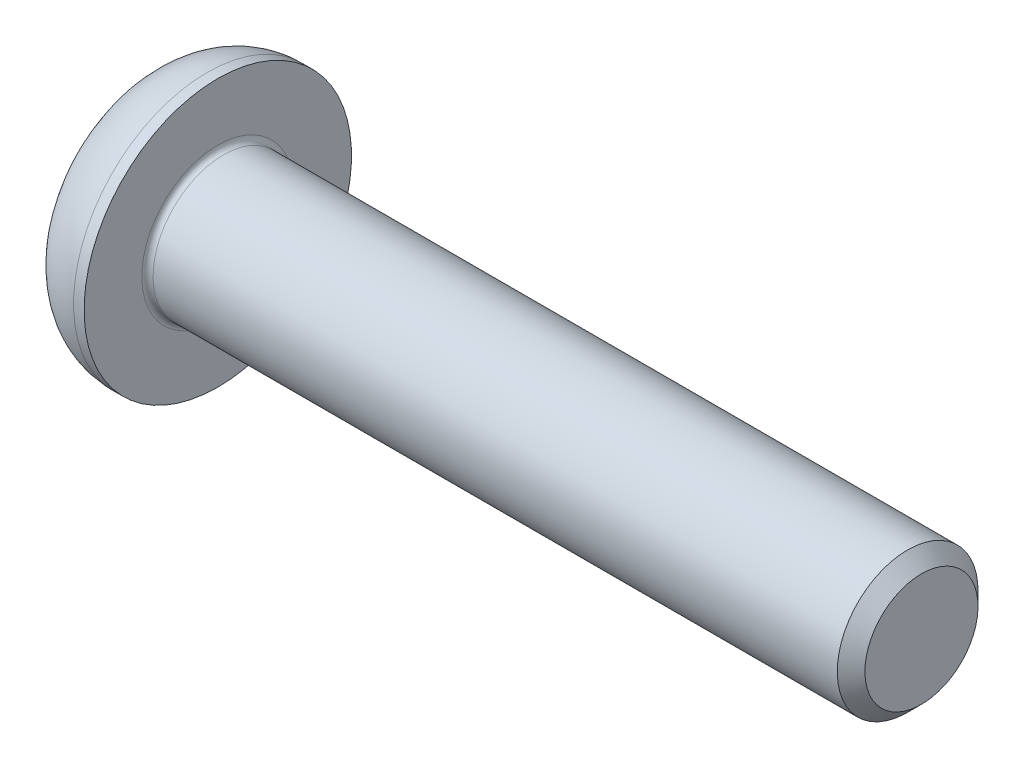
ISO-10303-21;
HEADER;
FILE_DESCRIPTION(('STEP AP214'),'2;1');
FILE_NAME('part.step','',(''),(''),'','','');
FILE_SCHEMA(('AUTOMOTIVE_DESIGN { 1 0 10303 214 1 1 1 1 }'));
ENDSEC;
DATA;
#1=APPLICATION_CONTEXT('core data for automotive mechanical design processes');
#2=APPLICATION_PROTOCOL_DEFINITION('international standard','automotive_design',2000,#1);
#3=PRODUCT_CONTEXT('',#1,'mechanical');
#4=PRODUCT('Part','Part','',(#3));
#5=PRODUCT_RELATED_PRODUCT_CATEGORY('part','',(#4));
#6=PRODUCT_DEFINITION_FORMATION('','',#4);
#7=PRODUCT_DEFINITION_CONTEXT('part definition',#1,'design');
#8=PRODUCT_DEFINITION('design','',#6,#7);
#9=PRODUCT_DEFINITION_SHAPE('','',#8);
#10=(LENGTH_UNIT() NAMED_UNIT(*) SI_UNIT(.MILLI.,.METRE.));
#11=(NAMED_UNIT(*) PLANE_ANGLE_UNIT() SI_UNIT($,.RADIAN.));
#12=(NAMED_UNIT(*) SI_UNIT($,.STERADIAN.) SOLID_ANGLE_UNIT());
#13=UNCERTAINTY_MEASURE_WITH_UNIT(LENGTH_MEASURE(1.E-05),#10,'distance_accuracy_value','');
#14=(GEOMETRIC_REPRESENTATION_CONTEXT(3) GLOBAL_UNCERTAINTY_ASSIGNED_CONTEXT((#13)) GLOBAL_UNIT_ASSIGNED_CONTEXT((#10,
#11,#12)) REPRESENTATION_CONTEXT('',''));
#15=CARTESIAN_POINT('',(0.,0.,0.));
#16=DIRECTION('',(0.,0.,1.));
#17=DIRECTION('',(1.,0.,0.));
#18=AXIS2_PLACEMENT_3D('',#15,#16,#17);
#19=CARTESIAN_POINT('',(0.200000000000002,0.,0.));
#20=DIRECTION('',(1.,0.,0.));
#21=DIRECTION('',(0.,1.,0.));
#22=AXIS2_PLACEMENT_3D('',#19,#20,#21);
#23=TOROIDAL_SURFACE('',#22,2.7,0.2);
#24=CARTESIAN_POINT('',(0.,0.,0.));
#25=DIRECTION('',(1.,0.,0.));
#26=DIRECTION('',(0.,1.,0.));
#27=AXIS2_PLACEMENT_3D('',#24,#25,#26);
#28=CIRCLE('',#27,2.7);
#29=CARTESIAN_POINT('',(0.,2.7,0.));
#30=VERTEX_POINT('',#29);
#31=EDGE_CURVE('E11',#30,#30,#28,.T.);
#32=ORIENTED_EDGE('',*,*,#31,.T.);
#33=EDGE_LOOP('',(#32));
#34=FACE_BOUND('',#33,.T.);
#35=CARTESIAN_POINT('',(0.200000000000002,0.,0.));
#36=DIRECTION('',(-1.,0.,0.));
#37=DIRECTION('',(0.,1.,0.));
#38=AXIS2_PLACEMENT_3D('',#35,#36,#37);
#39=CIRCLE('',#38,2.5);
#40=CARTESIAN_POINT('',(0.200000000000002,2.5,0.));
#41=VERTEX_POINT('',#40);
#42=EDGE_CURVE('E27',#41,#41,#39,.T.);
#43=ORIENTED_EDGE('',*,*,#42,.T.);
#44=EDGE_LOOP('',(#43));
#45=FACE_BOUND('',#44,.T.);
#46=ADVANCED_FACE('F16',(#34,#45),#23,.F.);
#47=CARTESIAN_POINT('',(13.3,0.,0.));
#48=DIRECTION('',(1.,0.,0.));
#49=DIRECTION('',(0.,1.,0.));
#50=AXIS2_PLACEMENT_3D('',#47,#48,#49);
#51=CYLINDRICAL_SURFACE('',#50,2.5);
#52=CARTESIAN_POINT('',(24.50924,0.,0.));
#53=DIRECTION('',(1.,0.,0.));
#54=DIRECTION('',(0.,1.,0.));
#55=AXIS2_PLACEMENT_3D('',#52,#53,#54);
#56=CIRCLE('',#55,2.5);
#57=CARTESIAN_POINT('',(24.50924,2.5,0.));
#58=VERTEX_POINT('',#57);
#59=EDGE_CURVE('E161',#58,#58,#56,.T.);
#60=ORIENTED_EDGE('',*,*,#59,.F.);
#61=EDGE_LOOP('',(#60));
#62=FACE_BOUND('',#61,.T.);
#63=ORIENTED_EDGE('',*,*,#42,.F.);
#64=EDGE_LOOP('',(#63));
#65=FACE_BOUND('',#64,.T.);
#66=ADVANCED_FACE('F171',(#62,#65),#51,.T.);
#67=CARTESIAN_POINT('',(0.,3.625,0.));
#68=DIRECTION('',(1.,0.,0.));
#69=DIRECTION('',(0.,1.,0.));
#70=AXIS2_PLACEMENT_3D('',#67,#68,#69);
#71=PLANE('',#70);
#72=CARTESIAN_POINT('',(0.,0.,0.));
#73=DIRECTION('',(1.,0.,0.));
#74=DIRECTION('',(0.,1.,0.));
#75=AXIS2_PLACEMENT_3D('',#72,#73,#74);
#76=CIRCLE('',#75,4.75);
#77=CARTESIAN_POINT('',(0.,4.75,0.));
#78=VERTEX_POINT('',#77);
#79=EDGE_CURVE('E162',#78,#78,#76,.T.);
#80=ORIENTED_EDGE('',*,*,#79,.T.);
#81=EDGE_LOOP('',(#80));
#82=FACE_BOUND('',#81,.T.);
#83=ORIENTED_EDGE('',*,*,#31,.F.);
#84=EDGE_LOOP('',(#83));
#85=FACE_BOUND('',#84,.T.);
#86=ADVANCED_FACE('F173',(#82,#85),#71,.T.);
#87=CARTESIAN_POINT('',(24.75462,0.,0.));
#88=DIRECTION('',(-1.,0.,0.));
#89=DIRECTION('',(0.,1.,0.));
#90=AXIS2_PLACEMENT_3D('',#87,#88,#89);
#91=CONICAL_SURFACE('',#90,2.25462,0.785398163397447);
#92=ORIENTED_EDGE('',*,*,#59,.T.);
#93=EDGE_LOOP('',(#92));
#94=FACE_BOUND('',#93,.T.);
#95=CARTESIAN_POINT('',(25.,0.,0.));
#96=DIRECTION('',(-1.,0.,0.));
#97=DIRECTION('',(0.,1.,0.));
#98=AXIS2_PLACEMENT_3D('',#95,#96,#97);
#99=CIRCLE('',#98,2.00924);
#100=CARTESIAN_POINT('',(25.,2.00924,0.));
#101=VERTEX_POINT('',#100);
#102=EDGE_CURVE('E158',#101,#101,#99,.T.);
#103=ORIENTED_EDGE('',*,*,#102,.T.);
#104=EDGE_LOOP('',(#103));
#105=FACE_BOUND('',#104,.T.);
#106=ADVANCED_FACE('F181',(#94,#105),#91,.T.);
#107=CARTESIAN_POINT('',(25.,1.25,0.));
#108=DIRECTION('',(1.,0.,0.));
#109=DIRECTION('',(0.,1.,0.));
#110=AXIS2_PLACEMENT_3D('',#107,#108,#109);
#111=PLANE('',#110);
#112=ORIENTED_EDGE('',*,*,#102,.F.);
#113=EDGE_LOOP('',(#112));
#114=FACE_BOUND('',#113,.T.);
#115=ADVANCED_FACE('F191',(#114),#111,.T.);
#116=CARTESIAN_POINT('',(-0.374999999999994,0.,0.));
#117=DIRECTION('',(1.,0.,0.));
#118=DIRECTION('',(0.,1.,0.));
#119=AXIS2_PLACEMENT_3D('',#116,#117,#118);
#120=TOROIDAL_SURFACE('',#119,2.375,2.375);
#121=CARTESIAN_POINT('',(-2.74999999999999,0.,0.));
#122=DIRECTION('',(1.,0.,0.));
#123=DIRECTION('',(0.,1.,0.));
#124=AXIS2_PLACEMENT_3D('',#121,#122,#123);
#125=CIRCLE('',#124,2.375);
#126=CARTESIAN_POINT('',(-2.74999999999999,2.375,0.));
#127=VERTEX_POINT('',#126);
#128=EDGE_CURVE('E155',#127,#127,#125,.T.);
#129=ORIENTED_EDGE('',*,*,#128,.T.);
#130=EDGE_LOOP('',(#129));
#131=FACE_BOUND('',#130,.T.);
#132=CARTESIAN_POINT('',(-0.374999999999994,0.,0.));
#133=DIRECTION('',(-1.,0.,0.));
#134=DIRECTION('',(0.,1.,0.));
#135=AXIS2_PLACEMENT_3D('',#132,#133,#134);
#136=CIRCLE('',#135,4.75);
#137=CARTESIAN_POINT('',(-0.374999999999994,4.75,0.));
#138=VERTEX_POINT('',#137);
#139=EDGE_CURVE('E152',#138,#138,#136,.T.);
#140=ORIENTED_EDGE('',*,*,#139,.T.);
#141=EDGE_LOOP('',(#140));
#142=FACE_BOUND('',#141,.T.);
#143=ADVANCED_FACE('F205',(#131,#142),#120,.T.);
#144=CARTESIAN_POINT('',(-2.74999999999999,3.24102540378444,0.));
#145=DIRECTION('',(-1.,0.,0.));
#146=DIRECTION('',(0.,-1.,0.));
#147=AXIS2_PLACEMENT_3D('',#144,#145,#146);
#148=PLANE('',#147);
#149=DIRECTION('',(0.,0.,1.));
#150=VECTOR('',#149,1.);
#151=CARTESIAN_POINT('',(-2.74999999999999,1.5,0.433012701892218));
#152=LINE('',#151,#150);
#153=CARTESIAN_POINT('',(-2.74999999999999,1.5,-0.866025403784439));
#154=VERTEX_POINT('',#153);
#155=CARTESIAN_POINT('',(-2.74999999999999,1.5,0.866025403784437));
#156=VERTEX_POINT('',#155);
#157=EDGE_CURVE('E150',#154,#156,#152,.T.);
#158=ORIENTED_EDGE('',*,*,#157,.T.);
#159=DIRECTION('',(0.,-0.866025403784438,0.500000000000001));
#160=VECTOR('',#159,1.);
#161=CARTESIAN_POINT('',(-2.74999999999999,0.375,1.51554445662277));
#162=LINE('',#161,#160);
#163=CARTESIAN_POINT('',(-2.74999999999999,0.,1.73205080756888));
#164=VERTEX_POINT('',#163);
#165=EDGE_CURVE('E39',#156,#164,#162,.T.);
#166=ORIENTED_EDGE('',*,*,#165,.T.);
#167=DIRECTION('',(0.,-0.866025403784439,-0.5));
#168=VECTOR('',#167,1.);
#169=CARTESIAN_POINT('',(-2.74999999999999,-1.125,1.08253175473055));
#170=LINE('',#169,#168);
#171=CARTESIAN_POINT('',(-2.74999999999999,-1.5,0.866025403784439));
#172=VERTEX_POINT('',#171);
#173=EDGE_CURVE('E95',#164,#172,#170,.T.);
#174=ORIENTED_EDGE('',*,*,#173,.T.);
#175=DIRECTION('',(0.,0.,-1.));
#176=VECTOR('',#175,1.);
#177=CARTESIAN_POINT('',(-2.74999999999999,-1.5,-0.433012701892219));
#178=LINE('',#177,#176);
#179=CARTESIAN_POINT('',(-2.74999999999999,-1.5,-0.866025403784438));
#180=VERTEX_POINT('',#179);
#181=EDGE_CURVE('E88',#172,#180,#178,.T.);
#182=ORIENTED_EDGE('',*,*,#181,.T.);
#183=DIRECTION('',(0.,0.866025403784439,-0.5));
#184=VECTOR('',#183,1.);
#185=CARTESIAN_POINT('',(-2.74999999999999,-0.375,-1.51554445662277));
#186=LINE('',#185,#184);
#187=CARTESIAN_POINT('',(-2.74999999999999,0.,-1.73205080756888));
#188=VERTEX_POINT('',#187);
#189=EDGE_CURVE('E144',#180,#188,#186,.T.);
#190=ORIENTED_EDGE('',*,*,#189,.T.);
#191=DIRECTION('',(0.,0.866025403784439,0.5));
#192=VECTOR('',#191,1.);
#193=CARTESIAN_POINT('',(-2.74999999999999,1.125,-1.08253175473055));
#194=LINE('',#193,#192);
#195=EDGE_CURVE('E135',#188,#154,#194,.T.);
#196=ORIENTED_EDGE('',*,*,#195,.T.);
#197=EDGE_LOOP('',(#158,#166,#174,#182,#190,#196));
#198=FACE_BOUND('',#197,.T.);
#199=ORIENTED_EDGE('',*,*,#128,.F.);
#200=EDGE_LOOP('',(#199));
#201=FACE_BOUND('',#200,.T.);
#202=ADVANCED_FACE('F196',(#198,#201),#148,.T.);
#203=CARTESIAN_POINT('',(-1.375,0.,0.));
#204=DIRECTION('',(1.,0.,0.));
#205=DIRECTION('',(0.,1.,0.));
#206=AXIS2_PLACEMENT_3D('',#203,#204,#205);
#207=CYLINDRICAL_SURFACE('',#206,4.75);
#208=ORIENTED_EDGE('',*,*,#79,.F.);
#209=EDGE_LOOP('',(#208));
#210=FACE_BOUND('',#209,.T.);
#211=ORIENTED_EDGE('',*,*,#139,.F.);
#212=EDGE_LOOP('',(#211));
#213=FACE_BOUND('',#212,.T.);
#214=ADVANCED_FACE('F193',(#210,#213),#207,.T.);
#215=CARTESIAN_POINT('',(-2.74999999999999,0.,-1.73205080756888));
#216=DIRECTION('',(0.,-0.5,-0.866025403784439));
#217=DIRECTION('',(0.,0.866025403784439,-0.5));
#218=AXIS2_PLACEMENT_3D('',#215,#216,#217);
#219=PLANE('',#218);
#220=CARTESIAN_POINT('',(-1.18999999999999,0.,-1.73205080756887));
#221=CARTESIAN_POINT('',(-0.939999999999999,-0.750000000000001,-1.29903810567666));
#222=CARTESIAN_POINT('',(-1.18999999999999,-1.49999999999999,-0.866025403784445));
#223=(BOUNDED_CURVE() B_SPLINE_CURVE(2,(#220,#221,#222),.UNSPECIFIED.,.F.,
.F.) B_SPLINE_CURVE_WITH_KNOTS((3,3),(0.,0.175265420711685),
.UNSPECIFIED.) CURVE() GEOMETRIC_REPRESENTATION_ITEM() RATIONAL_B_SPLINE_CURVE((1.,
1.15470053837925,1.)) REPRESENTATION_ITEM(''));
#224=CARTESIAN_POINT('',(-1.19,0.,-1.73205080756888));
#225=VERTEX_POINT('',#224);
#226=CARTESIAN_POINT('',(-1.19,-1.5,-0.866025403784438));
#227=VERTEX_POINT('',#226);
#228=EDGE_CURVE('E79',#225,#227,#223,.T.);
#229=ORIENTED_EDGE('',*,*,#228,.F.);
#230=DIRECTION('',(-1.,0.,0.));
#231=VECTOR('',#230,1.);
#232=CARTESIAN_POINT('',(-1.96999999999999,0.,-1.73205080756888));
#233=LINE('',#232,#231);
#234=EDGE_CURVE('E125',#225,#188,#233,.T.);
#235=ORIENTED_EDGE('',*,*,#234,.T.);
#236=ORIENTED_EDGE('',*,*,#189,.F.);
#237=DIRECTION('',(-1.,0.,0.));
#238=VECTOR('',#237,1.);
#239=CARTESIAN_POINT('',(-1.96999999999999,-1.5,-0.866025403784438));
#240=LINE('',#239,#238);
#241=EDGE_CURVE('E91',#227,#180,#240,.T.);
#242=ORIENTED_EDGE('',*,*,#241,.F.);
#243=EDGE_LOOP('',(#229,#235,#236,#242));
#244=FACE_BOUND('',#243,.T.);
#245=ADVANCED_FACE('F195',(#244),#219,.F.);
#246=CARTESIAN_POINT('',(-2.74999999999999,1.5,-0.866025403784439));
#247=DIRECTION('',(0.,0.5,-0.866025403784439));
#248=DIRECTION('',(0.,0.866025403784439,0.5));
#249=AXIS2_PLACEMENT_3D('',#246,#247,#248);
#250=PLANE('',#249);
#251=CARTESIAN_POINT('',(-1.18999999999999,1.49999999999999,-0.866025403784445));
#252=CARTESIAN_POINT('',(-0.939999999999999,0.75,-1.29903810567666));
#253=CARTESIAN_POINT('',(-1.18999999999999,0.,-1.73205080756887));
#254=(BOUNDED_CURVE() B_SPLINE_CURVE(2,(#251,#252,#253),.UNSPECIFIED.,.F.,
.F.) B_SPLINE_CURVE_WITH_KNOTS((3,3),(0.,0.175265420711685),
.UNSPECIFIED.) CURVE() GEOMETRIC_REPRESENTATION_ITEM() RATIONAL_B_SPLINE_CURVE((1.,
1.15470053837924,1.)) REPRESENTATION_ITEM(''));
#255=CARTESIAN_POINT('',(-1.19,1.5,-0.866025403784441));
#256=VERTEX_POINT('',#255);
#257=EDGE_CURVE('E119',#256,#225,#254,.T.);
#258=ORIENTED_EDGE('',*,*,#257,.F.);
#259=DIRECTION('',(-1.,0.,0.));
#260=VECTOR('',#259,1.);
#261=CARTESIAN_POINT('',(-1.96999999999999,1.5,-0.866025403784441));
#262=LINE('',#261,#260);
#263=EDGE_CURVE('E114',#256,#154,#262,.T.);
#264=ORIENTED_EDGE('',*,*,#263,.T.);
#265=ORIENTED_EDGE('',*,*,#195,.F.);
#266=ORIENTED_EDGE('',*,*,#234,.F.);
#267=EDGE_LOOP('',(#258,#264,#265,#266));
#268=FACE_BOUND('',#267,.T.);
#269=ADVANCED_FACE('F202',(#268),#250,.F.);
#270=CARTESIAN_POINT('',(-2.74999999999999,1.5,0.866025403784437));
#271=DIRECTION('',(0.,1.,0.));
#272=DIRECTION('',(0.,0.,1.));
#273=AXIS2_PLACEMENT_3D('',#270,#271,#272);
#274=PLANE('',#273);
#275=CARTESIAN_POINT('',(-1.18999999999999,1.5,0.866025403784425));
#276=CARTESIAN_POINT('',(-0.939999999999999,1.5,0.));
#277=CARTESIAN_POINT('',(-1.18999999999999,1.5,-0.866025403784428));
#278=(BOUNDED_CURVE() B_SPLINE_CURVE(2,(#275,#276,#277),.UNSPECIFIED.,.F.,
.F.) B_SPLINE_CURVE_WITH_KNOTS((3,3),(0.,0.175265420711685),
.UNSPECIFIED.) CURVE() GEOMETRIC_REPRESENTATION_ITEM() RATIONAL_B_SPLINE_CURVE((1.,
1.15470053837924,1.)) REPRESENTATION_ITEM(''));
#279=CARTESIAN_POINT('',(-1.19,1.5,0.866025403784437));
#280=VERTEX_POINT('',#279);
#281=EDGE_CURVE('E98',#280,#256,#278,.T.);
#282=ORIENTED_EDGE('',*,*,#281,.F.);
#283=DIRECTION('',(-1.,0.,0.));
#284=VECTOR('',#283,1.);
#285=CARTESIAN_POINT('',(-1.96999999999999,1.5,0.866025403784437));
#286=LINE('',#285,#284);
#287=EDGE_CURVE('E108',#280,#156,#286,.T.);
#288=ORIENTED_EDGE('',*,*,#287,.T.);
#289=ORIENTED_EDGE('',*,*,#157,.F.);
#290=ORIENTED_EDGE('',*,*,#263,.F.);
#291=EDGE_LOOP('',(#282,#288,#289,#290));
#292=FACE_BOUND('',#291,.T.);
#293=ADVANCED_FACE('F223',(#292),#274,.F.);
#294=CARTESIAN_POINT('',(-2.74999999999999,0.,1.73205080756888));
#295=DIRECTION('',(0.,0.500000000000001,0.866025403784438));
#296=DIRECTION('',(0.,-0.866025403784438,0.500000000000001));
#297=AXIS2_PLACEMENT_3D('',#294,#295,#296);
#298=PLANE('',#297);
#299=CARTESIAN_POINT('',(-1.18999999999999,0.,1.73205080756887));
#300=CARTESIAN_POINT('',(-0.939999999999998,0.750000000000001,1.29903810567666));
#301=CARTESIAN_POINT('',(-1.18999999999999,1.49999999999999,0.866025403784443));
#302=(BOUNDED_CURVE() B_SPLINE_CURVE(2,(#299,#300,#301),.UNSPECIFIED.,.F.,
.F.) B_SPLINE_CURVE_WITH_KNOTS((3,3),(0.,0.175265420711685),
.UNSPECIFIED.) CURVE() GEOMETRIC_REPRESENTATION_ITEM() RATIONAL_B_SPLINE_CURVE((1.,
1.15470053837924,1.)) REPRESENTATION_ITEM(''));
#303=CARTESIAN_POINT('',(-1.19,0.,1.73205080756888));
#304=VERTEX_POINT('',#303);
#305=EDGE_CURVE('E96',#304,#280,#302,.T.);
#306=ORIENTED_EDGE('',*,*,#305,.F.);
#307=DIRECTION('',(1.,0.,0.));
#308=VECTOR('',#307,1.);
#309=CARTESIAN_POINT('',(-1.96999999999999,0.,1.73205080756888));
#310=LINE('',#309,#308);
#311=EDGE_CURVE('E92',#164,#304,#310,.T.);
#312=ORIENTED_EDGE('',*,*,#311,.F.);
#313=ORIENTED_EDGE('',*,*,#165,.F.);
#314=ORIENTED_EDGE('',*,*,#287,.F.);
#315=EDGE_LOOP('',(#306,#312,#313,#314));
#316=FACE_BOUND('',#315,.T.);
#317=ADVANCED_FACE('F227',(#316),#298,.F.);
#318=CARTESIAN_POINT('',(-2.74999999999999,-1.5,-0.866025403784438));
#319=DIRECTION('',(0.,-1.,0.));
#320=DIRECTION('',(0.,0.,-1.));
#321=AXIS2_PLACEMENT_3D('',#318,#319,#320);
#322=PLANE('',#321);
#323=CARTESIAN_POINT('',(-1.18999999999999,-1.5,-0.866025403784426));
#324=CARTESIAN_POINT('',(-0.939999999999999,-1.5,0.));
#325=CARTESIAN_POINT('',(-1.18999999999999,-1.5,0.866025403784426));
#326=(BOUNDED_CURVE() B_SPLINE_CURVE(2,(#323,#324,#325),.UNSPECIFIED.,.F.,
.F.) B_SPLINE_CURVE_WITH_KNOTS((3,3),(0.,0.175265420711685),
.UNSPECIFIED.) CURVE() GEOMETRIC_REPRESENTATION_ITEM() RATIONAL_B_SPLINE_CURVE((1.,
1.15470053837924,1.)) REPRESENTATION_ITEM(''));
#327=CARTESIAN_POINT('',(-1.19,-1.5,0.866025403784438));
#328=VERTEX_POINT('',#327);
#329=EDGE_CURVE('E74',#227,#328,#326,.T.);
#330=ORIENTED_EDGE('',*,*,#329,.F.);
#331=ORIENTED_EDGE('',*,*,#241,.T.);
#332=ORIENTED_EDGE('',*,*,#181,.F.);
#333=DIRECTION('',(-1.,0.,0.));
#334=VECTOR('',#333,1.);
#335=CARTESIAN_POINT('',(-1.96999999999999,-1.5,0.866025403784438));
#336=LINE('',#335,#334);
#337=EDGE_CURVE('E85',#328,#172,#336,.T.);
#338=ORIENTED_EDGE('',*,*,#337,.F.);
#339=EDGE_LOOP('',(#330,#331,#332,#338));
#340=FACE_BOUND('',#339,.T.);
#341=ADVANCED_FACE('F86',(#340),#322,.F.);
#342=CARTESIAN_POINT('',(-2.74999999999999,-1.5,0.866025403784439));
#343=DIRECTION('',(0.,-0.5,0.866025403784439));
#344=DIRECTION('',(0.,-0.866025403784439,-0.5));
#345=AXIS2_PLACEMENT_3D('',#342,#343,#344);
#346=PLANE('',#345);
#347=CARTESIAN_POINT('',(-1.18999999999999,-1.49999999999999,0.866025403784445));
#348=CARTESIAN_POINT('',(-0.939999999999999,-0.75,1.29903810567666));
#349=CARTESIAN_POINT('',(-1.18999999999999,0.,1.73205080756887));
#350=(BOUNDED_CURVE() B_SPLINE_CURVE(2,(#347,#348,#349),.UNSPECIFIED.,.F.,
.F.) B_SPLINE_CURVE_WITH_KNOTS((3,3),(0.,0.175265420711685),
.UNSPECIFIED.) CURVE() GEOMETRIC_REPRESENTATION_ITEM() RATIONAL_B_SPLINE_CURVE((1.,
1.15470053837925,1.)) REPRESENTATION_ITEM(''));
#351=EDGE_CURVE('E20',#328,#304,#350,.T.);
#352=ORIENTED_EDGE('',*,*,#351,.F.);
#353=ORIENTED_EDGE('',*,*,#337,.T.);
#354=ORIENTED_EDGE('',*,*,#173,.F.);
#355=ORIENTED_EDGE('',*,*,#311,.T.);
#356=EDGE_LOOP('',(#352,#353,#354,#355));
#357=FACE_BOUND('',#356,.T.);
#358=ADVANCED_FACE('F94',(#357),#346,.F.);
#359=CARTESIAN_POINT('',(-0.689999999999995,0.,0.));
#360=DIRECTION('',(-1.,0.,0.));
#361=DIRECTION('',(0.,1.,0.));
#362=AXIS2_PLACEMENT_3D('',#359,#360,#361);
#363=CONICAL_SURFACE('',#362,0.866025403784439,1.0471975511966);
#364=CARTESIAN_POINT('',(-0.189999999999993,0.,0.));
#365=VERTEX_POINT('',#364);
#366=VERTEX_LOOP('',#365);
#367=FACE_BOUND('',#366,.T.);
#368=ORIENTED_EDGE('',*,*,#305,.T.);
#369=ORIENTED_EDGE('',*,*,#281,.T.);
#370=ORIENTED_EDGE('',*,*,#257,.T.);
#371=ORIENTED_EDGE('',*,*,#228,.T.);
#372=ORIENTED_EDGE('',*,*,#329,.T.);
#373=ORIENTED_EDGE('',*,*,#351,.T.);
#374=EDGE_LOOP('',(#368,#369,#370,#371,#372,#373));
#375=FACE_BOUND('',#374,.T.);
#376=ADVANCED_FACE('F18',(#367,#375),#363,.F.);
#377=CLOSED_SHELL('',(#46,#66,#86,#106,#115,#143,#202,#214,#245,#269,#293,#317,#341,#358,#376));
#378=MANIFOLD_SOLID_BREP('B1',#377);
#379=ADVANCED_BREP_SHAPE_REPRESENTATION('',(#18,#378),#14);
#380=SHAPE_DEFINITION_REPRESENTATION(#9,#379);
ENDSEC;
END-ISO-10303-21;
